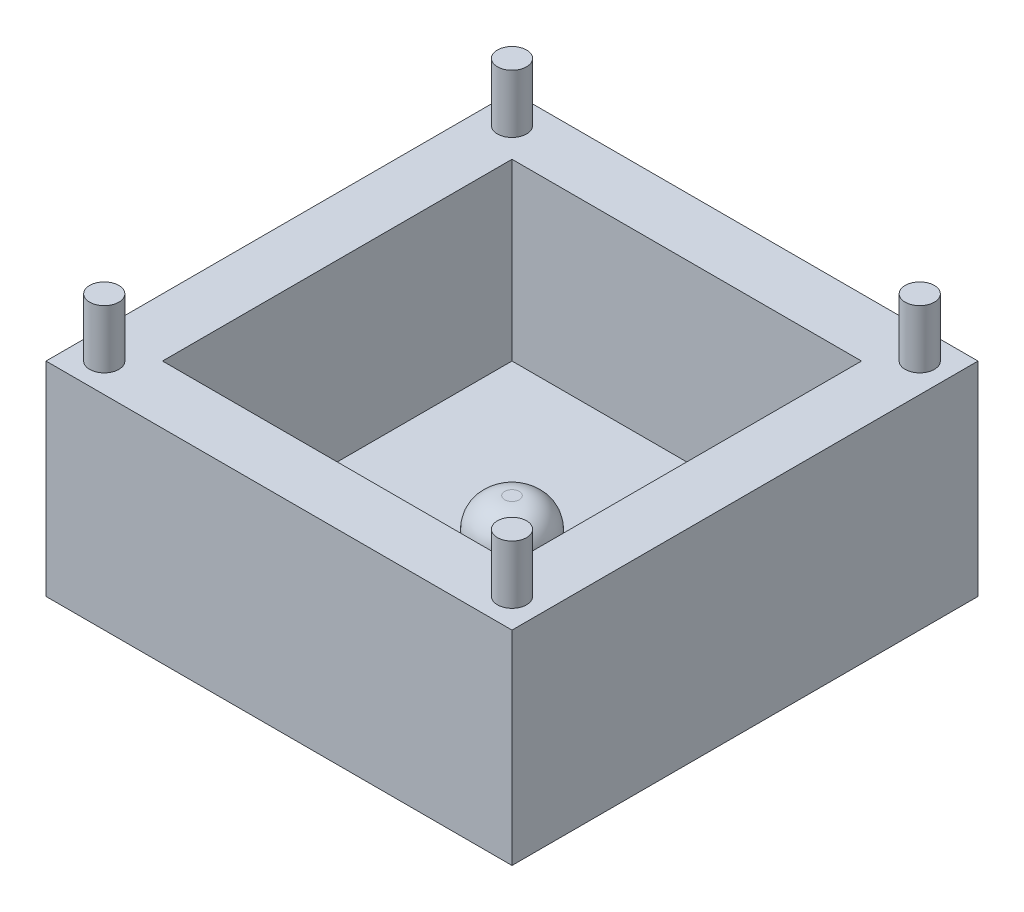
ISO-10303-21;
HEADER;
FILE_DESCRIPTION(('STEP AP214'),'2;1');
FILE_NAME('part.step','',(''),(''),'','','');
FILE_SCHEMA(('AUTOMOTIVE_DESIGN { 1 0 10303 214 1 1 1 1 }'));
ENDSEC;
DATA;
#1=APPLICATION_CONTEXT('core data for automotive mechanical design processes');
#2=APPLICATION_PROTOCOL_DEFINITION('international standard','automotive_design',2000,#1);
#3=PRODUCT_CONTEXT('',#1,'mechanical');
#4=PRODUCT('Part','Part','',(#3));
#5=PRODUCT_RELATED_PRODUCT_CATEGORY('part','',(#4));
#6=PRODUCT_DEFINITION_FORMATION('','',#4);
#7=PRODUCT_DEFINITION_CONTEXT('part definition',#1,'design');
#8=PRODUCT_DEFINITION('design','',#6,#7);
#9=PRODUCT_DEFINITION_SHAPE('','',#8);
#10=(LENGTH_UNIT() NAMED_UNIT(*) SI_UNIT(.MILLI.,.METRE.));
#11=(NAMED_UNIT(*) PLANE_ANGLE_UNIT() SI_UNIT($,.RADIAN.));
#12=(NAMED_UNIT(*) SI_UNIT($,.STERADIAN.) SOLID_ANGLE_UNIT());
#13=UNCERTAINTY_MEASURE_WITH_UNIT(LENGTH_MEASURE(1.E-05),#10,'distance_accuracy_value','');
#14=(GEOMETRIC_REPRESENTATION_CONTEXT(3) GLOBAL_UNCERTAINTY_ASSIGNED_CONTEXT((#13)) GLOBAL_UNIT_ASSIGNED_CONTEXT((#10,
#11,#12)) REPRESENTATION_CONTEXT('',''));
#15=CARTESIAN_POINT('',(0.,0.,0.));
#16=DIRECTION('',(0.,0.,1.));
#17=DIRECTION('',(1.,0.,0.));
#18=AXIS2_PLACEMENT_3D('',#15,#16,#17);
#19=CARTESIAN_POINT('',(8.,7.,8.));
#20=DIRECTION('',(-1.,0.,0.));
#21=DIRECTION('',(0.,0.,1.));
#22=AXIS2_PLACEMENT_3D('',#19,#20,#21);
#23=PLANE('',#22);
#24=DIRECTION('',(0.,0.,-1.));
#25=VECTOR('',#24,1.);
#26=CARTESIAN_POINT('',(8.,0.,8.));
#27=LINE('',#26,#25);
#28=CARTESIAN_POINT('',(8.,0.,8.));
#29=VERTEX_POINT('',#28);
#30=CARTESIAN_POINT('',(8.,0.,-8.));
#31=VERTEX_POINT('',#30);
#32=EDGE_CURVE('E146',#29,#31,#27,.T.);
#33=ORIENTED_EDGE('',*,*,#32,.T.);
#34=DIRECTION('',(0.,-1.,0.));
#35=VECTOR('',#34,1.);
#36=CARTESIAN_POINT('',(8.,7.,-8.));
#37=LINE('',#36,#35);
#38=CARTESIAN_POINT('',(8.,7.,-8.));
#39=VERTEX_POINT('',#38);
#40=EDGE_CURVE('E170',#39,#31,#37,.T.);
#41=ORIENTED_EDGE('',*,*,#40,.F.);
#42=DIRECTION('',(0.,0.,-1.));
#43=VECTOR('',#42,1.);
#44=CARTESIAN_POINT('',(8.,7.,8.));
#45=LINE('',#44,#43);
#46=CARTESIAN_POINT('',(8.,7.,8.));
#47=VERTEX_POINT('',#46);
#48=EDGE_CURVE('E150',#47,#39,#45,.T.);
#49=ORIENTED_EDGE('',*,*,#48,.F.);
#50=DIRECTION('',(0.,-1.,0.));
#51=VECTOR('',#50,1.);
#52=CARTESIAN_POINT('',(8.,7.,8.));
#53=LINE('',#52,#51);
#54=EDGE_CURVE('E156',#47,#29,#53,.T.);
#55=ORIENTED_EDGE('',*,*,#54,.T.);
#56=EDGE_LOOP('',(#33,#41,#49,#55));
#57=FACE_BOUND('',#56,.T.);
#58=ADVANCED_FACE('F33',(#57),#23,.F.);
#59=CARTESIAN_POINT('',(-8.,7.,-8.));
#60=DIRECTION('',(0.,0.,1.));
#61=DIRECTION('',(1.,0.,0.));
#62=AXIS2_PLACEMENT_3D('',#59,#60,#61);
#63=PLANE('',#62);
#64=DIRECTION('',(-1.,0.,0.));
#65=VECTOR('',#64,1.);
#66=CARTESIAN_POINT('',(-8.,0.,-8.));
#67=LINE('',#66,#65);
#68=CARTESIAN_POINT('',(-8.,0.,-8.));
#69=VERTEX_POINT('',#68);
#70=EDGE_CURVE('E159',#31,#69,#67,.T.);
#71=ORIENTED_EDGE('',*,*,#70,.T.);
#72=DIRECTION('',(0.,-1.,0.));
#73=VECTOR('',#72,1.);
#74=CARTESIAN_POINT('',(-8.,7.,-8.));
#75=LINE('',#74,#73);
#76=CARTESIAN_POINT('',(-8.,7.,-8.));
#77=VERTEX_POINT('',#76);
#78=EDGE_CURVE('E167',#77,#69,#75,.T.);
#79=ORIENTED_EDGE('',*,*,#78,.F.);
#80=DIRECTION('',(-1.,0.,0.));
#81=VECTOR('',#80,1.);
#82=CARTESIAN_POINT('',(-8.,7.,-8.));
#83=LINE('',#82,#81);
#84=EDGE_CURVE('E86',#39,#77,#83,.T.);
#85=ORIENTED_EDGE('',*,*,#84,.F.);
#86=ORIENTED_EDGE('',*,*,#40,.T.);
#87=EDGE_LOOP('',(#71,#79,#85,#86));
#88=FACE_BOUND('',#87,.T.);
#89=ADVANCED_FACE('F207',(#88),#63,.F.);
#90=CARTESIAN_POINT('',(-8.,7.,8.));
#91=DIRECTION('',(1.,0.,0.));
#92=DIRECTION('',(0.,0.,-1.));
#93=AXIS2_PLACEMENT_3D('',#90,#91,#92);
#94=PLANE('',#93);
#95=DIRECTION('',(0.,0.,1.));
#96=VECTOR('',#95,1.);
#97=CARTESIAN_POINT('',(-8.,0.,8.));
#98=LINE('',#97,#96);
#99=CARTESIAN_POINT('',(-8.,0.,8.));
#100=VERTEX_POINT('',#99);
#101=EDGE_CURVE('E161',#69,#100,#98,.T.);
#102=ORIENTED_EDGE('',*,*,#101,.T.);
#103=DIRECTION('',(0.,-1.,0.));
#104=VECTOR('',#103,1.);
#105=CARTESIAN_POINT('',(-8.,7.,8.));
#106=LINE('',#105,#104);
#107=CARTESIAN_POINT('',(-8.,7.,8.));
#108=VERTEX_POINT('',#107);
#109=EDGE_CURVE('E165',#108,#100,#106,.T.);
#110=ORIENTED_EDGE('',*,*,#109,.F.);
#111=DIRECTION('',(0.,0.,1.));
#112=VECTOR('',#111,1.);
#113=CARTESIAN_POINT('',(-8.,7.,8.));
#114=LINE('',#113,#112);
#115=EDGE_CURVE('E153',#77,#108,#114,.T.);
#116=ORIENTED_EDGE('',*,*,#115,.F.);
#117=ORIENTED_EDGE('',*,*,#78,.T.);
#118=EDGE_LOOP('',(#102,#110,#116,#117));
#119=FACE_BOUND('',#118,.T.);
#120=ADVANCED_FACE('F212',(#119),#94,.F.);
#121=CARTESIAN_POINT('',(-8.,7.,8.));
#122=DIRECTION('',(0.,0.,-1.));
#123=DIRECTION('',(-1.,0.,0.));
#124=AXIS2_PLACEMENT_3D('',#121,#122,#123);
#125=PLANE('',#124);
#126=DIRECTION('',(1.,0.,0.));
#127=VECTOR('',#126,1.);
#128=CARTESIAN_POINT('',(-8.,0.,8.));
#129=LINE('',#128,#127);
#130=EDGE_CURVE('E78',#100,#29,#129,.T.);
#131=ORIENTED_EDGE('',*,*,#130,.T.);
#132=ORIENTED_EDGE('',*,*,#54,.F.);
#133=DIRECTION('',(1.,0.,0.));
#134=VECTOR('',#133,1.);
#135=CARTESIAN_POINT('',(-8.,7.,8.));
#136=LINE('',#135,#134);
#137=EDGE_CURVE('E57',#108,#47,#136,.T.);
#138=ORIENTED_EDGE('',*,*,#137,.F.);
#139=ORIENTED_EDGE('',*,*,#109,.T.);
#140=EDGE_LOOP('',(#131,#132,#138,#139));
#141=FACE_BOUND('',#140,.T.);
#142=ADVANCED_FACE('F195',(#141),#125,.F.);
#143=CARTESIAN_POINT('',(0.,7.,0.));
#144=DIRECTION('',(0.,-1.,0.));
#145=DIRECTION('',(0.,0.,-1.));
#146=AXIS2_PLACEMENT_3D('',#143,#144,#145);
#147=PLANE('',#146);
#148=CARTESIAN_POINT('',(-7.,7.,7.));
#149=DIRECTION('',(0.,-1.,0.));
#150=DIRECTION('',(0.,0.,-1.));
#151=AXIS2_PLACEMENT_3D('',#148,#149,#150);
#152=CIRCLE('',#151,0.500000000000002);
#153=CARTESIAN_POINT('',(-7.,7.,6.5));
#154=VERTEX_POINT('',#153);
#155=EDGE_CURVE('E11',#154,#154,#152,.F.);
#156=ORIENTED_EDGE('',*,*,#155,.F.);
#157=EDGE_LOOP('',(#156));
#158=FACE_BOUND('',#157,.T.);
#159=CARTESIAN_POINT('',(7.,7.,7.));
#160=DIRECTION('',(0.,-1.,0.));
#161=DIRECTION('',(0.,0.,-1.));
#162=AXIS2_PLACEMENT_3D('',#159,#160,#161);
#163=CIRCLE('',#162,0.5);
#164=CARTESIAN_POINT('',(7.,7.,6.5));
#165=VERTEX_POINT('',#164);
#166=EDGE_CURVE('E41',#165,#165,#163,.F.);
#167=ORIENTED_EDGE('',*,*,#166,.F.);
#168=EDGE_LOOP('',(#167));
#169=FACE_BOUND('',#168,.T.);
#170=CARTESIAN_POINT('',(7.,7.,-7.));
#171=DIRECTION('',(0.,-1.,0.));
#172=DIRECTION('',(0.,0.,-1.));
#173=AXIS2_PLACEMENT_3D('',#170,#171,#172);
#174=CIRCLE('',#173,0.500000000000002);
#175=CARTESIAN_POINT('',(7.,7.,-7.5));
#176=VERTEX_POINT('',#175);
#177=EDGE_CURVE('E184',#176,#176,#174,.F.);
#178=ORIENTED_EDGE('',*,*,#177,.F.);
#179=EDGE_LOOP('',(#178));
#180=FACE_BOUND('',#179,.T.);
#181=CARTESIAN_POINT('',(-7.,7.,-7.));
#182=DIRECTION('',(0.,-1.,0.));
#183=DIRECTION('',(0.,0.,-1.));
#184=AXIS2_PLACEMENT_3D('',#181,#182,#183);
#185=CIRCLE('',#184,0.500000000000002);
#186=CARTESIAN_POINT('',(-7.,7.,-7.5));
#187=VERTEX_POINT('',#186);
#188=EDGE_CURVE('E181',#187,#187,#185,.F.);
#189=ORIENTED_EDGE('',*,*,#188,.F.);
#190=EDGE_LOOP('',(#189));
#191=FACE_BOUND('',#190,.T.);
#192=DIRECTION('',(-1.,0.,0.));
#193=VECTOR('',#192,1.);
#194=CARTESIAN_POINT('',(-6.,7.,-6.));
#195=LINE('',#194,#193);
#196=CARTESIAN_POINT('',(6.,7.,-6.));
#197=VERTEX_POINT('',#196);
#198=CARTESIAN_POINT('',(-6.,7.,-6.));
#199=VERTEX_POINT('',#198);
#200=EDGE_CURVE('E140',#197,#199,#195,.T.);
#201=ORIENTED_EDGE('',*,*,#200,.F.);
#202=DIRECTION('',(0.,0.,-1.));
#203=VECTOR('',#202,1.);
#204=CARTESIAN_POINT('',(6.,7.,6.));
#205=LINE('',#204,#203);
#206=CARTESIAN_POINT('',(6.,7.,6.));
#207=VERTEX_POINT('',#206);
#208=EDGE_CURVE('E48',#207,#197,#205,.T.);
#209=ORIENTED_EDGE('',*,*,#208,.F.);
#210=DIRECTION('',(1.,0.,0.));
#211=VECTOR('',#210,1.);
#212=CARTESIAN_POINT('',(-6.,7.,6.));
#213=LINE('',#212,#211);
#214=CARTESIAN_POINT('',(-6.,7.,6.));
#215=VERTEX_POINT('',#214);
#216=EDGE_CURVE('E128',#215,#207,#213,.T.);
#217=ORIENTED_EDGE('',*,*,#216,.F.);
#218=DIRECTION('',(0.,0.,1.));
#219=VECTOR('',#218,1.);
#220=CARTESIAN_POINT('',(-6.,7.,6.));
#221=LINE('',#220,#219);
#222=EDGE_CURVE('E131',#199,#215,#221,.T.);
#223=ORIENTED_EDGE('',*,*,#222,.F.);
#224=EDGE_LOOP('',(#201,#209,#217,#223));
#225=FACE_BOUND('',#224,.T.);
#226=ORIENTED_EDGE('',*,*,#48,.T.);
#227=ORIENTED_EDGE('',*,*,#84,.T.);
#228=ORIENTED_EDGE('',*,*,#115,.T.);
#229=ORIENTED_EDGE('',*,*,#137,.T.);
#230=EDGE_LOOP('',(#226,#227,#228,#229));
#231=FACE_BOUND('',#230,.T.);
#232=ADVANCED_FACE('F191',(#158,#169,#180,#191,#225,#231),#147,.F.);
#233=CARTESIAN_POINT('',(0.,0.,0.));
#234=DIRECTION('',(0.,-1.,0.));
#235=DIRECTION('',(0.,0.,-1.));
#236=AXIS2_PLACEMENT_3D('',#233,#234,#235);
#237=PLANE('',#236);
#238=ORIENTED_EDGE('',*,*,#32,.F.);
#239=ORIENTED_EDGE('',*,*,#130,.F.);
#240=ORIENTED_EDGE('',*,*,#101,.F.);
#241=ORIENTED_EDGE('',*,*,#70,.F.);
#242=EDGE_LOOP('',(#238,#239,#240,#241));
#243=FACE_BOUND('',#242,.T.);
#244=ADVANCED_FACE('F194',(#243),#237,.T.);
#245=CARTESIAN_POINT('',(6.,1.,6.));
#246=DIRECTION('',(1.,0.,0.));
#247=DIRECTION('',(0.,0.,-1.));
#248=AXIS2_PLACEMENT_3D('',#245,#246,#247);
#249=PLANE('',#248);
#250=ORIENTED_EDGE('',*,*,#208,.T.);
#251=DIRECTION('',(0.,1.,0.));
#252=VECTOR('',#251,1.);
#253=CARTESIAN_POINT('',(6.,1.,-6.));
#254=LINE('',#253,#252);
#255=CARTESIAN_POINT('',(6.,1.,-6.));
#256=VERTEX_POINT('',#255);
#257=EDGE_CURVE('E106',#256,#197,#254,.T.);
#258=ORIENTED_EDGE('',*,*,#257,.F.);
#259=DIRECTION('',(0.,0.,-1.));
#260=VECTOR('',#259,1.);
#261=CARTESIAN_POINT('',(6.,1.,6.));
#262=LINE('',#261,#260);
#263=CARTESIAN_POINT('',(6.,1.,6.));
#264=VERTEX_POINT('',#263);
#265=EDGE_CURVE('E110',#264,#256,#262,.T.);
#266=ORIENTED_EDGE('',*,*,#265,.F.);
#267=DIRECTION('',(0.,1.,0.));
#268=VECTOR('',#267,1.);
#269=CARTESIAN_POINT('',(6.,1.,6.));
#270=LINE('',#269,#268);
#271=EDGE_CURVE('E144',#264,#207,#270,.T.);
#272=ORIENTED_EDGE('',*,*,#271,.T.);
#273=EDGE_LOOP('',(#250,#258,#266,#272));
#274=FACE_BOUND('',#273,.T.);
#275=ADVANCED_FACE('F108',(#274),#249,.F.);
#276=CARTESIAN_POINT('',(-6.,1.,6.));
#277=DIRECTION('',(0.,0.,1.));
#278=DIRECTION('',(1.,0.,0.));
#279=AXIS2_PLACEMENT_3D('',#276,#277,#278);
#280=PLANE('',#279);
#281=ORIENTED_EDGE('',*,*,#216,.T.);
#282=ORIENTED_EDGE('',*,*,#271,.F.);
#283=DIRECTION('',(1.,0.,0.));
#284=VECTOR('',#283,1.);
#285=CARTESIAN_POINT('',(-6.,1.,6.));
#286=LINE('',#285,#284);
#287=CARTESIAN_POINT('',(-6.,1.,6.));
#288=VERTEX_POINT('',#287);
#289=EDGE_CURVE('E116',#288,#264,#286,.T.);
#290=ORIENTED_EDGE('',*,*,#289,.F.);
#291=DIRECTION('',(0.,1.,0.));
#292=VECTOR('',#291,1.);
#293=CARTESIAN_POINT('',(-6.,1.,6.));
#294=LINE('',#293,#292);
#295=EDGE_CURVE('E147',#288,#215,#294,.T.);
#296=ORIENTED_EDGE('',*,*,#295,.T.);
#297=EDGE_LOOP('',(#281,#282,#290,#296));
#298=FACE_BOUND('',#297,.T.);
#299=ADVANCED_FACE('F219',(#298),#280,.F.);
#300=CARTESIAN_POINT('',(-6.,1.,6.));
#301=DIRECTION('',(-1.,0.,0.));
#302=DIRECTION('',(0.,0.,1.));
#303=AXIS2_PLACEMENT_3D('',#300,#301,#302);
#304=PLANE('',#303);
#305=ORIENTED_EDGE('',*,*,#222,.T.);
#306=ORIENTED_EDGE('',*,*,#295,.F.);
#307=DIRECTION('',(0.,0.,1.));
#308=VECTOR('',#307,1.);
#309=CARTESIAN_POINT('',(-6.,1.,6.));
#310=LINE('',#309,#308);
#311=CARTESIAN_POINT('',(-6.,1.,-6.));
#312=VERTEX_POINT('',#311);
#313=EDGE_CURVE('E124',#312,#288,#310,.T.);
#314=ORIENTED_EDGE('',*,*,#313,.F.);
#315=DIRECTION('',(0.,1.,0.));
#316=VECTOR('',#315,1.);
#317=CARTESIAN_POINT('',(-6.,1.,-6.));
#318=LINE('',#317,#316);
#319=EDGE_CURVE('E115',#312,#199,#318,.T.);
#320=ORIENTED_EDGE('',*,*,#319,.T.);
#321=EDGE_LOOP('',(#305,#306,#314,#320));
#322=FACE_BOUND('',#321,.T.);
#323=ADVANCED_FACE('F342',(#322),#304,.F.);
#324=CARTESIAN_POINT('',(-6.,1.,-6.));
#325=DIRECTION('',(0.,0.,-1.));
#326=DIRECTION('',(-1.,0.,0.));
#327=AXIS2_PLACEMENT_3D('',#324,#325,#326);
#328=PLANE('',#327);
#329=ORIENTED_EDGE('',*,*,#200,.T.);
#330=ORIENTED_EDGE('',*,*,#319,.F.);
#331=DIRECTION('',(-1.,0.,0.));
#332=VECTOR('',#331,1.);
#333=CARTESIAN_POINT('',(-6.,1.,-6.));
#334=LINE('',#333,#332);
#335=EDGE_CURVE('E119',#256,#312,#334,.T.);
#336=ORIENTED_EDGE('',*,*,#335,.F.);
#337=ORIENTED_EDGE('',*,*,#257,.T.);
#338=EDGE_LOOP('',(#329,#330,#336,#337));
#339=FACE_BOUND('',#338,.T.);
#340=ADVANCED_FACE('F120',(#339),#328,.F.);
#341=CARTESIAN_POINT('',(0.,1.,0.));
#342=DIRECTION('',(0.,-1.,0.));
#343=DIRECTION('',(0.,0.,-1.));
#344=AXIS2_PLACEMENT_3D('',#341,#342,#343);
#345=PLANE('',#344);
#346=CARTESIAN_POINT('',(0.,1.,0.));
#347=DIRECTION('',(0.,-1.,0.));
#348=DIRECTION('',(0.,0.,-1.));
#349=AXIS2_PLACEMENT_3D('',#346,#347,#348);
#350=CIRCLE('',#349,1.25);
#351=CARTESIAN_POINT('',(0.,1.,-1.25));
#352=VERTEX_POINT('',#351);
#353=EDGE_CURVE('E172',#352,#352,#350,.F.);
#354=ORIENTED_EDGE('',*,*,#353,.F.);
#355=EDGE_LOOP('',(#354));
#356=FACE_BOUND('',#355,.T.);
#357=ORIENTED_EDGE('',*,*,#265,.T.);
#358=ORIENTED_EDGE('',*,*,#335,.T.);
#359=ORIENTED_EDGE('',*,*,#313,.T.);
#360=ORIENTED_EDGE('',*,*,#289,.T.);
#361=EDGE_LOOP('',(#357,#358,#359,#360));
#362=FACE_BOUND('',#361,.T.);
#363=ADVANCED_FACE('F126',(#356,#362),#345,.F.);
#364=CARTESIAN_POINT('',(0.,3.,0.));
#365=DIRECTION('',(0.,-1.,0.));
#366=DIRECTION('',(0.,0.,-1.));
#367=AXIS2_PLACEMENT_3D('',#364,#365,#366);
#368=CYLINDRICAL_SURFACE('',#367,1.25);
#369=CARTESIAN_POINT('',(0.,2.,0.));
#370=DIRECTION('',(0.,1.,0.));
#371=DIRECTION('',(0.,0.,1.));
#372=AXIS2_PLACEMENT_3D('',#369,#370,#371);
#373=CIRCLE('',#372,1.25);
#374=CARTESIAN_POINT('',(0.,2.,1.25));
#375=VERTEX_POINT('',#374);
#376=EDGE_CURVE('E178',#375,#375,#373,.F.);
#377=ORIENTED_EDGE('',*,*,#376,.T.);
#378=EDGE_LOOP('',(#377));
#379=FACE_BOUND('',#378,.T.);
#380=ORIENTED_EDGE('',*,*,#353,.T.);
#381=EDGE_LOOP('',(#380));
#382=FACE_BOUND('',#381,.T.);
#383=ADVANCED_FACE('F332',(#379,#382),#368,.T.);
#384=CARTESIAN_POINT('',(0.,3.,0.));
#385=DIRECTION('',(0.,1.,0.));
#386=DIRECTION('',(0.,0.,1.));
#387=AXIS2_PLACEMENT_3D('',#384,#385,#386);
#388=PLANE('',#387);
#389=CARTESIAN_POINT('',(0.,3.,0.));
#390=DIRECTION('',(0.,1.,0.));
#391=DIRECTION('',(0.,0.,1.));
#392=AXIS2_PLACEMENT_3D('',#389,#390,#391);
#393=CIRCLE('',#392,0.25);
#394=CARTESIAN_POINT('',(0.,3.,0.25));
#395=VERTEX_POINT('',#394);
#396=EDGE_CURVE('E175',#395,#395,#393,.T.);
#397=ORIENTED_EDGE('',*,*,#396,.T.);
#398=EDGE_LOOP('',(#397));
#399=FACE_BOUND('',#398,.T.);
#400=ADVANCED_FACE('F329',(#399),#388,.T.);
#401=CARTESIAN_POINT('',(0.,2.,0.));
#402=DIRECTION('',(0.,1.,0.));
#403=DIRECTION('',(0.,0.,1.));
#404=AXIS2_PLACEMENT_3D('',#401,#402,#403);
#405=DEGENERATE_TOROIDAL_SURFACE('',#404,0.25,1.,.T.);
#406=ORIENTED_EDGE('',*,*,#376,.F.);
#407=EDGE_LOOP('',(#406));
#408=FACE_BOUND('',#407,.T.);
#409=ORIENTED_EDGE('',*,*,#396,.F.);
#410=EDGE_LOOP('',(#409));
#411=FACE_BOUND('',#410,.T.);
#412=ADVANCED_FACE('F35',(#408,#411),#405,.T.);
#413=CARTESIAN_POINT('',(-7.,9.,-7.));
#414=DIRECTION('',(0.,-1.,0.));
#415=DIRECTION('',(0.,0.,-1.));
#416=AXIS2_PLACEMENT_3D('',#413,#414,#415);
#417=CYLINDRICAL_SURFACE('',#416,0.500000000000002);
#418=CARTESIAN_POINT('',(-7.,9.,-7.));
#419=DIRECTION('',(0.,1.,0.));
#420=DIRECTION('',(0.,0.,1.));
#421=AXIS2_PLACEMENT_3D('',#418,#419,#420);
#422=CIRCLE('',#421,0.500000000000002);
#423=CARTESIAN_POINT('',(-7.,9.,-6.5));
#424=VERTEX_POINT('',#423);
#425=EDGE_CURVE('E134',#424,#424,#422,.T.);
#426=ORIENTED_EDGE('',*,*,#425,.F.);
#427=EDGE_LOOP('',(#426));
#428=FACE_BOUND('',#427,.T.);
#429=ORIENTED_EDGE('',*,*,#188,.T.);
#430=EDGE_LOOP('',(#429));
#431=FACE_BOUND('',#430,.T.);
#432=ADVANCED_FACE('F249',(#428,#431),#417,.T.);
#433=CARTESIAN_POINT('',(-7.,9.,-7.));
#434=DIRECTION('',(0.,1.,0.));
#435=DIRECTION('',(0.,0.,1.));
#436=AXIS2_PLACEMENT_3D('',#433,#434,#435);
#437=PLANE('',#436);
#438=ORIENTED_EDGE('',*,*,#425,.T.);
#439=EDGE_LOOP('',(#438));
#440=FACE_BOUND('',#439,.T.);
#441=ADVANCED_FACE('F254',(#440),#437,.T.);
#442=CARTESIAN_POINT('',(7.,9.,-7.));
#443=DIRECTION('',(0.,-1.,0.));
#444=DIRECTION('',(0.,0.,-1.));
#445=AXIS2_PLACEMENT_3D('',#442,#443,#444);
#446=CYLINDRICAL_SURFACE('',#445,0.500000000000002);
#447=CARTESIAN_POINT('',(7.,9.,-7.));
#448=DIRECTION('',(0.,1.,0.));
#449=DIRECTION('',(0.,0.,1.));
#450=AXIS2_PLACEMENT_3D('',#447,#448,#449);
#451=CIRCLE('',#450,0.500000000000002);
#452=CARTESIAN_POINT('',(7.,9.,-6.5));
#453=VERTEX_POINT('',#452);
#454=EDGE_CURVE('E407',#453,#453,#451,.T.);
#455=ORIENTED_EDGE('',*,*,#454,.F.);
#456=EDGE_LOOP('',(#455));
#457=FACE_BOUND('',#456,.T.);
#458=ORIENTED_EDGE('',*,*,#177,.T.);
#459=EDGE_LOOP('',(#458));
#460=FACE_BOUND('',#459,.T.);
#461=ADVANCED_FACE('F264',(#457,#460),#446,.T.);
#462=CARTESIAN_POINT('',(7.,9.,-7.));
#463=DIRECTION('',(0.,1.,0.));
#464=DIRECTION('',(0.,0.,1.));
#465=AXIS2_PLACEMENT_3D('',#462,#463,#464);
#466=PLANE('',#465);
#467=ORIENTED_EDGE('',*,*,#454,.T.);
#468=EDGE_LOOP('',(#467));
#469=FACE_BOUND('',#468,.T.);
#470=ADVANCED_FACE('F274',(#469),#466,.T.);
#471=CARTESIAN_POINT('',(7.,9.,7.));
#472=DIRECTION('',(0.,-1.,0.));
#473=DIRECTION('',(0.,0.,-1.));
#474=AXIS2_PLACEMENT_3D('',#471,#472,#473);
#475=CYLINDRICAL_SURFACE('',#474,0.5);
#476=CARTESIAN_POINT('',(7.,9.,7.));
#477=DIRECTION('',(0.,1.,0.));
#478=DIRECTION('',(0.,0.,1.));
#479=AXIS2_PLACEMENT_3D('',#476,#477,#478);
#480=CIRCLE('',#479,0.5);
#481=CARTESIAN_POINT('',(7.,9.,7.5));
#482=VERTEX_POINT('',#481);
#483=EDGE_CURVE('E404',#482,#482,#480,.T.);
#484=ORIENTED_EDGE('',*,*,#483,.F.);
#485=EDGE_LOOP('',(#484));
#486=FACE_BOUND('',#485,.T.);
#487=ORIENTED_EDGE('',*,*,#166,.T.);
#488=EDGE_LOOP('',(#487));
#489=FACE_BOUND('',#488,.T.);
#490=ADVANCED_FACE('F189',(#486,#489),#475,.T.);
#491=CARTESIAN_POINT('',(7.,9.,7.));
#492=DIRECTION('',(0.,1.,0.));
#493=DIRECTION('',(0.,0.,1.));
#494=AXIS2_PLACEMENT_3D('',#491,#492,#493);
#495=PLANE('',#494);
#496=ORIENTED_EDGE('',*,*,#483,.T.);
#497=EDGE_LOOP('',(#496));
#498=FACE_BOUND('',#497,.T.);
#499=ADVANCED_FACE('F293',(#498),#495,.T.);
#500=CARTESIAN_POINT('',(-7.,9.,7.));
#501=DIRECTION('',(0.,-1.,0.));
#502=DIRECTION('',(0.,0.,-1.));
#503=AXIS2_PLACEMENT_3D('',#500,#501,#502);
#504=CYLINDRICAL_SURFACE('',#503,0.500000000000002);
#505=CARTESIAN_POINT('',(-7.,9.,7.));
#506=DIRECTION('',(0.,1.,0.));
#507=DIRECTION('',(0.,0.,1.));
#508=AXIS2_PLACEMENT_3D('',#505,#506,#507);
#509=CIRCLE('',#508,0.500000000000002);
#510=CARTESIAN_POINT('',(-7.,9.,7.5));
#511=VERTEX_POINT('',#510);
#512=EDGE_CURVE('E403',#511,#511,#509,.T.);
#513=ORIENTED_EDGE('',*,*,#512,.F.);
#514=EDGE_LOOP('',(#513));
#515=FACE_BOUND('',#514,.T.);
#516=ORIENTED_EDGE('',*,*,#155,.T.);
#517=EDGE_LOOP('',(#516));
#518=FACE_BOUND('',#517,.T.);
#519=ADVANCED_FACE('F303',(#515,#518),#504,.T.);
#520=CARTESIAN_POINT('',(-7.,9.,7.));
#521=DIRECTION('',(0.,1.,0.));
#522=DIRECTION('',(0.,0.,1.));
#523=AXIS2_PLACEMENT_3D('',#520,#521,#522);
#524=PLANE('',#523);
#525=ORIENTED_EDGE('',*,*,#512,.T.);
#526=EDGE_LOOP('',(#525));
#527=FACE_BOUND('',#526,.T.);
#528=ADVANCED_FACE('F313',(#527),#524,.T.);
#529=CLOSED_SHELL('',(#58,#89,#120,#142,#232,#244,#275,#299,#323,#340,#363,#383,#400,#412,#432,
#441,#461,#470,#490,#499,#519,#528));
#530=MANIFOLD_SOLID_BREP('B2',#529);
#531=ADVANCED_BREP_SHAPE_REPRESENTATION('',(#18,#530),#14);
#532=SHAPE_DEFINITION_REPRESENTATION(#9,#531);
ENDSEC;
END-ISO-10303-21;
